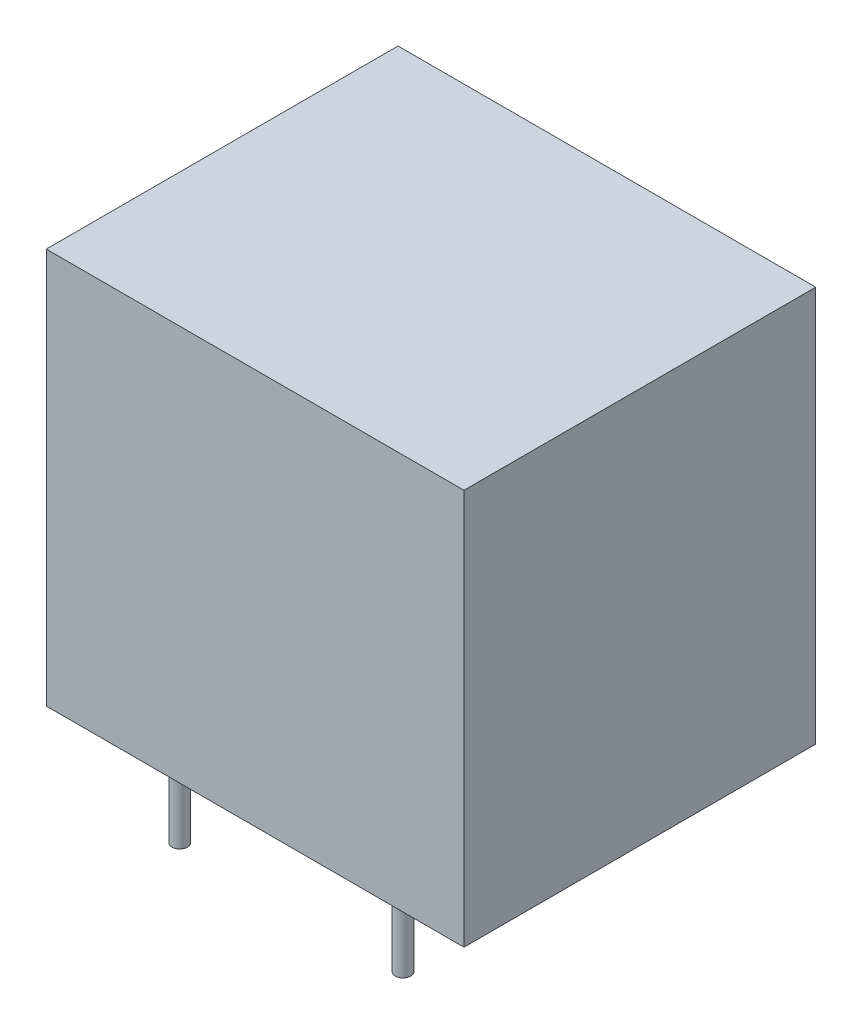
ISO-10303-21;
HEADER;
FILE_DESCRIPTION(('STEP AP214'),'2;1');
FILE_NAME('part.step','',(''),(''),'','','');
FILE_SCHEMA(('AUTOMOTIVE_DESIGN { 1 0 10303 214 1 1 1 1 }'));
ENDSEC;
DATA;
#1=APPLICATION_CONTEXT('core data for automotive mechanical design processes');
#2=APPLICATION_PROTOCOL_DEFINITION('international standard','automotive_design',2000,#1);
#3=PRODUCT_CONTEXT('',#1,'mechanical');
#4=PRODUCT('Part','Part','',(#3));
#5=PRODUCT_RELATED_PRODUCT_CATEGORY('part','',(#4));
#6=PRODUCT_DEFINITION_FORMATION('','',#4);
#7=PRODUCT_DEFINITION_CONTEXT('part definition',#1,'design');
#8=PRODUCT_DEFINITION('design','',#6,#7);
#9=PRODUCT_DEFINITION_SHAPE('','',#8);
#10=(LENGTH_UNIT() NAMED_UNIT(*) SI_UNIT(.MILLI.,.METRE.));
#11=(NAMED_UNIT(*) PLANE_ANGLE_UNIT() SI_UNIT($,.RADIAN.));
#12=(NAMED_UNIT(*) SI_UNIT($,.STERADIAN.) SOLID_ANGLE_UNIT());
#13=UNCERTAINTY_MEASURE_WITH_UNIT(LENGTH_MEASURE(1.E-05),#10,'distance_accuracy_value','');
#14=(GEOMETRIC_REPRESENTATION_CONTEXT(3) GLOBAL_UNCERTAINTY_ASSIGNED_CONTEXT((#13)) GLOBAL_UNIT_ASSIGNED_CONTEXT((#10,
#11,#12)) REPRESENTATION_CONTEXT('',''));
#15=CARTESIAN_POINT('',(0.,0.,0.));
#16=DIRECTION('',(0.,0.,1.));
#17=DIRECTION('',(1.,0.,0.));
#18=AXIS2_PLACEMENT_3D('',#15,#16,#17);
#19=CARTESIAN_POINT('',(9.5,18.,8.));
#20=DIRECTION('',(-1.,0.,0.));
#21=DIRECTION('',(0.,0.,1.));
#22=AXIS2_PLACEMENT_3D('',#19,#20,#21);
#23=PLANE('',#22);
#24=DIRECTION('',(0.,0.,-1.));
#25=VECTOR('',#24,1.);
#26=CARTESIAN_POINT('',(9.5,0.,8.));
#27=LINE('',#26,#25);
#28=CARTESIAN_POINT('',(9.5,0.,8.));
#29=VERTEX_POINT('',#28);
#30=CARTESIAN_POINT('',(9.5,0.,-8.));
#31=VERTEX_POINT('',#30);
#32=EDGE_CURVE('E98',#29,#31,#27,.T.);
#33=ORIENTED_EDGE('',*,*,#32,.T.);
#34=DIRECTION('',(0.,-1.,0.));
#35=VECTOR('',#34,1.);
#36=CARTESIAN_POINT('',(9.5,18.,-8.));
#37=LINE('',#36,#35);
#38=CARTESIAN_POINT('',(9.5,18.,-8.));
#39=VERTEX_POINT('',#38);
#40=EDGE_CURVE('E11',#39,#31,#37,.T.);
#41=ORIENTED_EDGE('',*,*,#40,.F.);
#42=DIRECTION('',(0.,0.,-1.));
#43=VECTOR('',#42,1.);
#44=CARTESIAN_POINT('',(9.5,18.,8.));
#45=LINE('',#44,#43);
#46=CARTESIAN_POINT('',(9.5,18.,8.));
#47=VERTEX_POINT('',#46);
#48=EDGE_CURVE('E86',#47,#39,#45,.T.);
#49=ORIENTED_EDGE('',*,*,#48,.F.);
#50=DIRECTION('',(0.,-1.,0.));
#51=VECTOR('',#50,1.);
#52=CARTESIAN_POINT('',(9.5,18.,8.));
#53=LINE('',#52,#51);
#54=EDGE_CURVE('E94',#47,#29,#53,.T.);
#55=ORIENTED_EDGE('',*,*,#54,.T.);
#56=EDGE_LOOP('',(#33,#41,#49,#55));
#57=FACE_BOUND('',#56,.T.);
#58=ADVANCED_FACE('F35',(#57),#23,.F.);
#59=CARTESIAN_POINT('',(-9.5,18.,-8.));
#60=DIRECTION('',(0.,0.,1.));
#61=DIRECTION('',(1.,0.,0.));
#62=AXIS2_PLACEMENT_3D('',#59,#60,#61);
#63=PLANE('',#62);
#64=DIRECTION('',(-1.,0.,0.));
#65=VECTOR('',#64,1.);
#66=CARTESIAN_POINT('',(-9.5,0.,-8.));
#67=LINE('',#66,#65);
#68=CARTESIAN_POINT('',(-9.5,0.,-8.));
#69=VERTEX_POINT('',#68);
#70=EDGE_CURVE('E90',#31,#69,#67,.T.);
#71=ORIENTED_EDGE('',*,*,#70,.T.);
#72=DIRECTION('',(0.,-1.,0.));
#73=VECTOR('',#72,1.);
#74=CARTESIAN_POINT('',(-9.5,18.,-8.));
#75=LINE('',#74,#73);
#76=CARTESIAN_POINT('',(-9.5,18.,-8.));
#77=VERTEX_POINT('',#76);
#78=EDGE_CURVE('E43',#77,#69,#75,.T.);
#79=ORIENTED_EDGE('',*,*,#78,.F.);
#80=DIRECTION('',(-1.,0.,0.));
#81=VECTOR('',#80,1.);
#82=CARTESIAN_POINT('',(-9.5,18.,-8.));
#83=LINE('',#82,#81);
#84=EDGE_CURVE('E81',#39,#77,#83,.T.);
#85=ORIENTED_EDGE('',*,*,#84,.F.);
#86=ORIENTED_EDGE('',*,*,#40,.T.);
#87=EDGE_LOOP('',(#71,#79,#85,#86));
#88=FACE_BOUND('',#87,.T.);
#89=ADVANCED_FACE('F89',(#88),#63,.F.);
#90=CARTESIAN_POINT('',(-9.5,18.,8.));
#91=DIRECTION('',(1.,0.,0.));
#92=DIRECTION('',(0.,0.,-1.));
#93=AXIS2_PLACEMENT_3D('',#90,#91,#92);
#94=PLANE('',#93);
#95=DIRECTION('',(0.,0.,1.));
#96=VECTOR('',#95,1.);
#97=CARTESIAN_POINT('',(-9.5,0.,8.));
#98=LINE('',#97,#96);
#99=CARTESIAN_POINT('',(-9.5,0.,8.));
#100=VERTEX_POINT('',#99);
#101=EDGE_CURVE('E68',#69,#100,#98,.T.);
#102=ORIENTED_EDGE('',*,*,#101,.T.);
#103=DIRECTION('',(0.,-1.,0.));
#104=VECTOR('',#103,1.);
#105=CARTESIAN_POINT('',(-9.5,18.,8.));
#106=LINE('',#105,#104);
#107=CARTESIAN_POINT('',(-9.5,18.,8.));
#108=VERTEX_POINT('',#107);
#109=EDGE_CURVE('E91',#108,#100,#106,.T.);
#110=ORIENTED_EDGE('',*,*,#109,.F.);
#111=DIRECTION('',(0.,0.,1.));
#112=VECTOR('',#111,1.);
#113=CARTESIAN_POINT('',(-9.5,18.,8.));
#114=LINE('',#113,#112);
#115=EDGE_CURVE('E84',#77,#108,#114,.T.);
#116=ORIENTED_EDGE('',*,*,#115,.F.);
#117=ORIENTED_EDGE('',*,*,#78,.T.);
#118=EDGE_LOOP('',(#102,#110,#116,#117));
#119=FACE_BOUND('',#118,.T.);
#120=ADVANCED_FACE('F92',(#119),#94,.F.);
#121=CARTESIAN_POINT('',(-9.5,18.,8.));
#122=DIRECTION('',(0.,0.,-1.));
#123=DIRECTION('',(-1.,0.,0.));
#124=AXIS2_PLACEMENT_3D('',#121,#122,#123);
#125=PLANE('',#124);
#126=DIRECTION('',(1.,0.,0.));
#127=VECTOR('',#126,1.);
#128=CARTESIAN_POINT('',(-9.5,0.,8.));
#129=LINE('',#128,#127);
#130=EDGE_CURVE('E74',#100,#29,#129,.T.);
#131=ORIENTED_EDGE('',*,*,#130,.T.);
#132=ORIENTED_EDGE('',*,*,#54,.F.);
#133=DIRECTION('',(1.,0.,0.));
#134=VECTOR('',#133,1.);
#135=CARTESIAN_POINT('',(-9.5,18.,8.));
#136=LINE('',#135,#134);
#137=EDGE_CURVE('E51',#108,#47,#136,.T.);
#138=ORIENTED_EDGE('',*,*,#137,.F.);
#139=ORIENTED_EDGE('',*,*,#109,.T.);
#140=EDGE_LOOP('',(#131,#132,#138,#139));
#141=FACE_BOUND('',#140,.T.);
#142=ADVANCED_FACE('F106',(#141),#125,.F.);
#143=CARTESIAN_POINT('',(0.,18.,0.));
#144=DIRECTION('',(0.,-1.,0.));
#145=DIRECTION('',(0.,0.,-1.));
#146=AXIS2_PLACEMENT_3D('',#143,#144,#145);
#147=PLANE('',#146);
#148=ORIENTED_EDGE('',*,*,#48,.T.);
#149=ORIENTED_EDGE('',*,*,#84,.T.);
#150=ORIENTED_EDGE('',*,*,#115,.T.);
#151=ORIENTED_EDGE('',*,*,#137,.T.);
#152=EDGE_LOOP('',(#148,#149,#150,#151));
#153=FACE_BOUND('',#152,.T.);
#154=ADVANCED_FACE('F82',(#153),#147,.F.);
#155=CARTESIAN_POINT('',(0.,0.,0.));
#156=DIRECTION('',(0.,-1.,0.));
#157=DIRECTION('',(0.,0.,-1.));
#158=AXIS2_PLACEMENT_3D('',#155,#156,#157);
#159=PLANE('',#158);
#160=CARTESIAN_POINT('',(-5.08,0.,-6.35));
#161=DIRECTION('',(0.,-1.,0.));
#162=DIRECTION('',(0.,0.,-1.));
#163=AXIS2_PLACEMENT_3D('',#160,#161,#162);
#164=CIRCLE('',#163,0.35);
#165=CARTESIAN_POINT('',(-5.08,0.,-6.7));
#166=VERTEX_POINT('',#165);
#167=EDGE_CURVE('E130',#166,#166,#164,.T.);
#168=ORIENTED_EDGE('',*,*,#167,.F.);
#169=EDGE_LOOP('',(#168));
#170=FACE_BOUND('',#169,.T.);
#171=CARTESIAN_POINT('',(5.08,0.,-6.35));
#172=DIRECTION('',(0.,-1.,0.));
#173=DIRECTION('',(0.,0.,-1.));
#174=AXIS2_PLACEMENT_3D('',#171,#172,#173);
#175=CIRCLE('',#174,0.35);
#176=CARTESIAN_POINT('',(5.08,0.,-6.7));
#177=VERTEX_POINT('',#176);
#178=EDGE_CURVE('E124',#177,#177,#175,.T.);
#179=ORIENTED_EDGE('',*,*,#178,.F.);
#180=EDGE_LOOP('',(#179));
#181=FACE_BOUND('',#180,.T.);
#182=CARTESIAN_POINT('',(5.08,0.,6.35));
#183=DIRECTION('',(0.,-1.,0.));
#184=DIRECTION('',(0.,0.,-1.));
#185=AXIS2_PLACEMENT_3D('',#182,#183,#184);
#186=CIRCLE('',#185,0.35);
#187=CARTESIAN_POINT('',(5.08,0.,6.));
#188=VERTEX_POINT('',#187);
#189=EDGE_CURVE('E118',#188,#188,#186,.T.);
#190=ORIENTED_EDGE('',*,*,#189,.F.);
#191=EDGE_LOOP('',(#190));
#192=FACE_BOUND('',#191,.T.);
#193=CARTESIAN_POINT('',(-5.08,0.,6.35));
#194=DIRECTION('',(0.,-1.,0.));
#195=DIRECTION('',(0.,0.,-1.));
#196=AXIS2_PLACEMENT_3D('',#193,#194,#195);
#197=CIRCLE('',#196,0.35);
#198=CARTESIAN_POINT('',(-5.08,0.,6.));
#199=VERTEX_POINT('',#198);
#200=EDGE_CURVE('E112',#199,#199,#197,.T.);
#201=ORIENTED_EDGE('',*,*,#200,.F.);
#202=EDGE_LOOP('',(#201));
#203=FACE_BOUND('',#202,.T.);
#204=ORIENTED_EDGE('',*,*,#32,.F.);
#205=ORIENTED_EDGE('',*,*,#130,.F.);
#206=ORIENTED_EDGE('',*,*,#101,.F.);
#207=ORIENTED_EDGE('',*,*,#70,.F.);
#208=EDGE_LOOP('',(#204,#205,#206,#207));
#209=FACE_BOUND('',#208,.T.);
#210=ADVANCED_FACE('F109',(#170,#181,#192,#203,#209),#159,.T.);
#211=CARTESIAN_POINT('',(-5.08,-4.,6.35));
#212=DIRECTION('',(0.,1.,0.));
#213=DIRECTION('',(0.,0.,1.));
#214=AXIS2_PLACEMENT_3D('',#211,#212,#213);
#215=CYLINDRICAL_SURFACE('',#214,0.35);
#216=CARTESIAN_POINT('',(-5.08,-4.,6.35));
#217=DIRECTION('',(0.,-1.,0.));
#218=DIRECTION('',(0.,0.,-1.));
#219=AXIS2_PLACEMENT_3D('',#216,#217,#218);
#220=CIRCLE('',#219,0.35);
#221=CARTESIAN_POINT('',(-5.08,-4.,6.));
#222=VERTEX_POINT('',#221);
#223=EDGE_CURVE('E101',#222,#222,#220,.T.);
#224=ORIENTED_EDGE('',*,*,#223,.F.);
#225=EDGE_LOOP('',(#224));
#226=FACE_BOUND('',#225,.T.);
#227=ORIENTED_EDGE('',*,*,#200,.T.);
#228=EDGE_LOOP('',(#227));
#229=FACE_BOUND('',#228,.T.);
#230=ADVANCED_FACE('F147',(#226,#229),#215,.T.);
#231=CARTESIAN_POINT('',(-5.08,-4.,6.35));
#232=DIRECTION('',(0.,-1.,0.));
#233=DIRECTION('',(0.,0.,-1.));
#234=AXIS2_PLACEMENT_3D('',#231,#232,#233);
#235=PLANE('',#234);
#236=ORIENTED_EDGE('',*,*,#223,.T.);
#237=EDGE_LOOP('',(#236));
#238=FACE_BOUND('',#237,.T.);
#239=ADVANCED_FACE('F156',(#238),#235,.T.);
#240=CARTESIAN_POINT('',(5.08,-4.,6.35));
#241=DIRECTION('',(0.,1.,0.));
#242=DIRECTION('',(0.,0.,1.));
#243=AXIS2_PLACEMENT_3D('',#240,#241,#242);
#244=CYLINDRICAL_SURFACE('',#243,0.35);
#245=CARTESIAN_POINT('',(5.08,-4.,6.35));
#246=DIRECTION('',(0.,-1.,0.));
#247=DIRECTION('',(0.,0.,-1.));
#248=AXIS2_PLACEMENT_3D('',#245,#246,#247);
#249=CIRCLE('',#248,0.35);
#250=CARTESIAN_POINT('',(5.08,-4.,6.));
#251=VERTEX_POINT('',#250);
#252=EDGE_CURVE('E115',#251,#251,#249,.T.);
#253=ORIENTED_EDGE('',*,*,#252,.F.);
#254=EDGE_LOOP('',(#253));
#255=FACE_BOUND('',#254,.T.);
#256=ORIENTED_EDGE('',*,*,#189,.T.);
#257=EDGE_LOOP('',(#256));
#258=FACE_BOUND('',#257,.T.);
#259=ADVANCED_FACE('F162',(#255,#258),#244,.T.);
#260=CARTESIAN_POINT('',(5.08,-4.,6.35));
#261=DIRECTION('',(0.,-1.,0.));
#262=DIRECTION('',(0.,0.,-1.));
#263=AXIS2_PLACEMENT_3D('',#260,#261,#262);
#264=PLANE('',#263);
#265=ORIENTED_EDGE('',*,*,#252,.T.);
#266=EDGE_LOOP('',(#265));
#267=FACE_BOUND('',#266,.T.);
#268=ADVANCED_FACE('F213',(#267),#264,.T.);
#269=CARTESIAN_POINT('',(5.08,-4.,-6.35));
#270=DIRECTION('',(0.,1.,0.));
#271=DIRECTION('',(0.,0.,1.));
#272=AXIS2_PLACEMENT_3D('',#269,#270,#271);
#273=CYLINDRICAL_SURFACE('',#272,0.35);
#274=CARTESIAN_POINT('',(5.08,-4.,-6.35));
#275=DIRECTION('',(0.,-1.,0.));
#276=DIRECTION('',(0.,0.,-1.));
#277=AXIS2_PLACEMENT_3D('',#274,#275,#276);
#278=CIRCLE('',#277,0.35);
#279=CARTESIAN_POINT('',(5.08,-4.,-6.7));
#280=VERTEX_POINT('',#279);
#281=EDGE_CURVE('E121',#280,#280,#278,.T.);
#282=ORIENTED_EDGE('',*,*,#281,.F.);
#283=EDGE_LOOP('',(#282));
#284=FACE_BOUND('',#283,.T.);
#285=ORIENTED_EDGE('',*,*,#178,.T.);
#286=EDGE_LOOP('',(#285));
#287=FACE_BOUND('',#286,.T.);
#288=ADVANCED_FACE('F224',(#284,#287),#273,.T.);
#289=CARTESIAN_POINT('',(5.08,-4.,-6.35));
#290=DIRECTION('',(0.,-1.,0.));
#291=DIRECTION('',(0.,0.,-1.));
#292=AXIS2_PLACEMENT_3D('',#289,#290,#291);
#293=PLANE('',#292);
#294=ORIENTED_EDGE('',*,*,#281,.T.);
#295=EDGE_LOOP('',(#294));
#296=FACE_BOUND('',#295,.T.);
#297=ADVANCED_FACE('F141',(#296),#293,.T.);
#298=CARTESIAN_POINT('',(-5.08,-4.,-6.35));
#299=DIRECTION('',(0.,1.,0.));
#300=DIRECTION('',(0.,0.,1.));
#301=AXIS2_PLACEMENT_3D('',#298,#299,#300);
#302=CYLINDRICAL_SURFACE('',#301,0.35);
#303=CARTESIAN_POINT('',(-5.08,-4.,-6.35));
#304=DIRECTION('',(0.,-1.,0.));
#305=DIRECTION('',(0.,0.,-1.));
#306=AXIS2_PLACEMENT_3D('',#303,#304,#305);
#307=CIRCLE('',#306,0.35);
#308=CARTESIAN_POINT('',(-5.08,-4.,-6.7));
#309=VERTEX_POINT('',#308);
#310=EDGE_CURVE('E127',#309,#309,#307,.T.);
#311=ORIENTED_EDGE('',*,*,#310,.F.);
#312=EDGE_LOOP('',(#311));
#313=FACE_BOUND('',#312,.T.);
#314=ORIENTED_EDGE('',*,*,#167,.T.);
#315=EDGE_LOOP('',(#314));
#316=FACE_BOUND('',#315,.T.);
#317=ADVANCED_FACE('F138',(#313,#316),#302,.T.);
#318=CARTESIAN_POINT('',(-5.08,-4.,-6.35));
#319=DIRECTION('',(0.,-1.,0.));
#320=DIRECTION('',(0.,0.,-1.));
#321=AXIS2_PLACEMENT_3D('',#318,#319,#320);
#322=PLANE('',#321);
#323=ORIENTED_EDGE('',*,*,#310,.T.);
#324=EDGE_LOOP('',(#323));
#325=FACE_BOUND('',#324,.T.);
#326=ADVANCED_FACE('F136',(#325),#322,.T.);
#327=CLOSED_SHELL('',(#58,#89,#120,#142,#154,#210,#230,#239,#259,#268,#288,#297,#317,#326));
#328=MANIFOLD_SOLID_BREP('B2',#327);
#329=ADVANCED_BREP_SHAPE_REPRESENTATION('',(#18,#328),#14);
#330=SHAPE_DEFINITION_REPRESENTATION(#9,#329);
ENDSEC;
END-ISO-10303-21;
